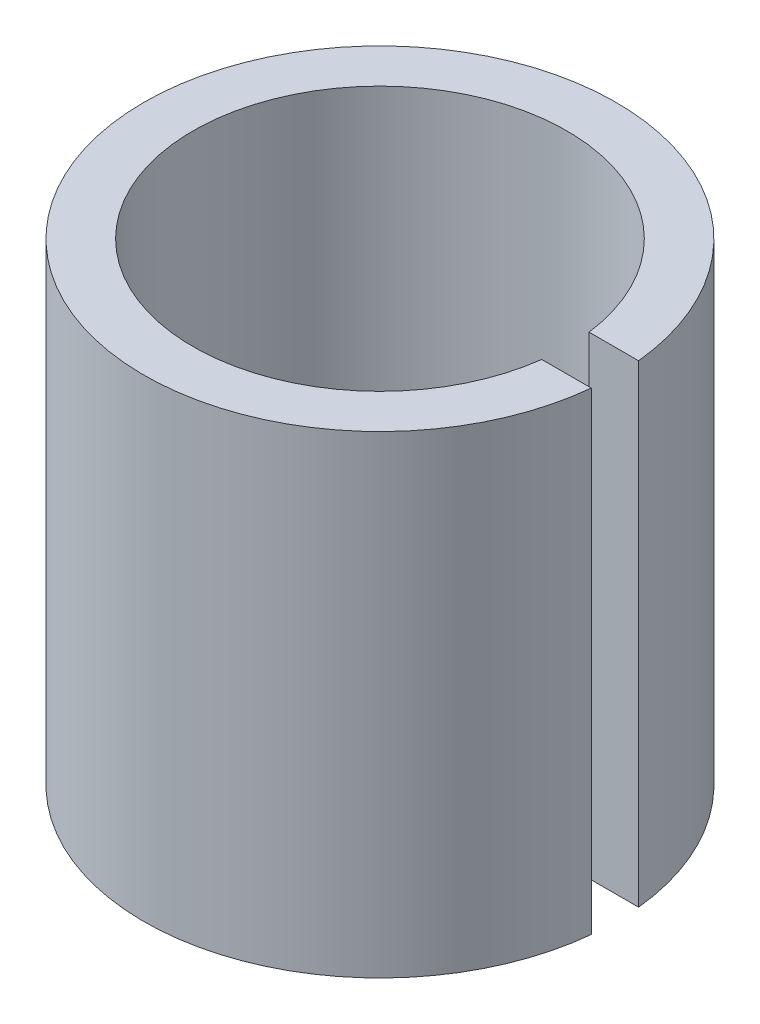
ISO-10303-21;
HEADER;
FILE_DESCRIPTION(('STEP AP214'),'2;1');
FILE_NAME('part.step','',(''),(''),'','','');
FILE_SCHEMA(('AUTOMOTIVE_DESIGN { 1 0 10303 214 1 1 1 1 }'));
ENDSEC;
DATA;
#1=APPLICATION_CONTEXT('core data for automotive mechanical design processes');
#2=APPLICATION_PROTOCOL_DEFINITION('international standard','automotive_design',2000,#1);
#3=PRODUCT_CONTEXT('',#1,'mechanical');
#4=PRODUCT('Part','Part','',(#3));
#5=PRODUCT_RELATED_PRODUCT_CATEGORY('part','',(#4));
#6=PRODUCT_DEFINITION_FORMATION('','',#4);
#7=PRODUCT_DEFINITION_CONTEXT('part definition',#1,'design');
#8=PRODUCT_DEFINITION('design','',#6,#7);
#9=PRODUCT_DEFINITION_SHAPE('','',#8);
#10=(LENGTH_UNIT() NAMED_UNIT(*) SI_UNIT(.MILLI.,.METRE.));
#11=(NAMED_UNIT(*) PLANE_ANGLE_UNIT() SI_UNIT($,.RADIAN.));
#12=(NAMED_UNIT(*) SI_UNIT($,.STERADIAN.) SOLID_ANGLE_UNIT());
#13=UNCERTAINTY_MEASURE_WITH_UNIT(LENGTH_MEASURE(1.E-05),#10,'distance_accuracy_value','');
#14=(GEOMETRIC_REPRESENTATION_CONTEXT(3) GLOBAL_UNCERTAINTY_ASSIGNED_CONTEXT((#13)) GLOBAL_UNIT_ASSIGNED_CONTEXT((#10,
#11,#12)) REPRESENTATION_CONTEXT('',''));
#15=CARTESIAN_POINT('',(0.,0.,0.));
#16=DIRECTION('',(0.,0.,1.));
#17=DIRECTION('',(1.,0.,0.));
#18=AXIS2_PLACEMENT_3D('',#15,#16,#17);
#19=CARTESIAN_POINT('',(-34.2752174495392,32.0392577935446,0.642077483917092));
#20=DIRECTION('',(0.,-1.,0.));
#21=DIRECTION('',(0.,0.,-1.));
#22=AXIS2_PLACEMENT_3D('',#19,#20,#21);
#23=CYLINDRICAL_SURFACE('',#22,6.3373);
#24=CARTESIAN_POINT('',(-34.2752174495392,19.3392577935446,0.642077483917092));
#25=DIRECTION('',(0.,1.,0.));
#26=DIRECTION('',(0.,0.,1.));
#27=AXIS2_PLACEMENT_3D('',#24,#25,#26);
#28=CIRCLE('',#27,6.3373);
#29=CARTESIAN_POINT('',(-27.9698113333561,19.3392577935446,0.00707748391709192));
#30=VERTEX_POINT('',#29);
#31=CARTESIAN_POINT('',(-27.9698113333561,19.3392577935446,1.27707748391709));
#32=VERTEX_POINT('',#31);
#33=EDGE_CURVE('E79',#30,#32,#28,.T.);
#34=ORIENTED_EDGE('',*,*,#33,.T.);
#35=DIRECTION('',(0.,-1.,0.));
#36=VECTOR('',#35,1.);
#37=CARTESIAN_POINT('',(-27.9698113333561,32.0392577935446,1.27707748391709));
#38=LINE('',#37,#36);
#39=CARTESIAN_POINT('',(-27.9698113333561,32.0392577935446,1.27707748391709));
#40=VERTEX_POINT('',#39);
#41=EDGE_CURVE('E10',#40,#32,#38,.T.);
#42=ORIENTED_EDGE('',*,*,#41,.F.);
#43=CARTESIAN_POINT('',(-34.2752174495392,32.0392577935446,0.642077483917092));
#44=DIRECTION('',(0.,1.,0.));
#45=DIRECTION('',(0.,0.,1.));
#46=AXIS2_PLACEMENT_3D('',#43,#44,#45);
#47=CIRCLE('',#46,6.3373);
#48=CARTESIAN_POINT('',(-27.9698113333561,32.0392577935446,0.00707748391709192));
#49=VERTEX_POINT('',#48);
#50=EDGE_CURVE('E67',#49,#40,#47,.T.);
#51=ORIENTED_EDGE('',*,*,#50,.F.);
#52=DIRECTION('',(0.,-1.,0.));
#53=VECTOR('',#52,1.);
#54=CARTESIAN_POINT('',(-27.9698113333561,32.0392577935446,0.00707748391709192));
#55=LINE('',#54,#53);
#56=EDGE_CURVE('E75',#49,#30,#55,.T.);
#57=ORIENTED_EDGE('',*,*,#56,.T.);
#58=EDGE_LOOP('',(#34,#42,#51,#57));
#59=FACE_BOUND('',#58,.T.);
#60=ADVANCED_FACE('F16',(#59),#23,.T.);
#61=CARTESIAN_POINT('',(-29.2990696171291,32.0392577935446,1.27707748391709));
#62=DIRECTION('',(0.,0.,1.));
#63=DIRECTION('',(1.,0.,0.));
#64=AXIS2_PLACEMENT_3D('',#61,#62,#63);
#65=PLANE('',#64);
#66=DIRECTION('',(-1.,0.,0.));
#67=VECTOR('',#66,1.);
#68=CARTESIAN_POINT('',(-29.2990696171291,19.3392577935446,1.27707748391709));
#69=LINE('',#68,#67);
#70=CARTESIAN_POINT('',(-29.2990696171291,19.3392577935446,1.27707748391709));
#71=VERTEX_POINT('',#70);
#72=EDGE_CURVE('E71',#32,#71,#69,.T.);
#73=ORIENTED_EDGE('',*,*,#72,.T.);
#74=DIRECTION('',(0.,-1.,0.));
#75=VECTOR('',#74,1.);
#76=CARTESIAN_POINT('',(-29.2990696171291,32.0392577935446,1.27707748391709));
#77=LINE('',#76,#75);
#78=CARTESIAN_POINT('',(-29.2990696171291,32.0392577935446,1.27707748391709));
#79=VERTEX_POINT('',#78);
#80=EDGE_CURVE('E24',#79,#71,#77,.T.);
#81=ORIENTED_EDGE('',*,*,#80,.F.);
#82=DIRECTION('',(-1.,0.,0.));
#83=VECTOR('',#82,1.);
#84=CARTESIAN_POINT('',(-29.2990696171291,32.0392577935446,1.27707748391709));
#85=LINE('',#84,#83);
#86=EDGE_CURVE('E62',#40,#79,#85,.T.);
#87=ORIENTED_EDGE('',*,*,#86,.F.);
#88=ORIENTED_EDGE('',*,*,#41,.T.);
#89=EDGE_LOOP('',(#73,#81,#87,#88));
#90=FACE_BOUND('',#89,.T.);
#91=ADVANCED_FACE('F70',(#90),#65,.F.);
#92=CARTESIAN_POINT('',(-34.2752174495392,32.0392577935446,0.642077483917092));
#93=DIRECTION('',(0.,-1.,0.));
#94=DIRECTION('',(0.,0.,-1.));
#95=AXIS2_PLACEMENT_3D('',#92,#93,#94);
#96=CYLINDRICAL_SURFACE('',#95,5.0165);
#97=CARTESIAN_POINT('',(-34.2752174495392,19.3392577935446,0.642077483917092));
#98=DIRECTION('',(0.,-1.,0.));
#99=DIRECTION('',(0.,0.,1.));
#100=AXIS2_PLACEMENT_3D('',#97,#98,#99);
#101=CIRCLE('',#100,5.0165);
#102=CARTESIAN_POINT('',(-29.2990696171291,19.3392577935446,0.00707748391709224));
#103=VERTEX_POINT('',#102);
#104=EDGE_CURVE('E49',#71,#103,#101,.T.);
#105=ORIENTED_EDGE('',*,*,#104,.T.);
#106=DIRECTION('',(0.,-1.,0.));
#107=VECTOR('',#106,1.);
#108=CARTESIAN_POINT('',(-29.2990696171291,32.0392577935446,0.00707748391709224));
#109=LINE('',#108,#107);
#110=CARTESIAN_POINT('',(-29.2990696171291,32.0392577935446,0.00707748391709224));
#111=VERTEX_POINT('',#110);
#112=EDGE_CURVE('E72',#111,#103,#109,.T.);
#113=ORIENTED_EDGE('',*,*,#112,.F.);
#114=CARTESIAN_POINT('',(-34.2752174495392,32.0392577935446,0.642077483917092));
#115=DIRECTION('',(0.,-1.,0.));
#116=DIRECTION('',(0.,0.,1.));
#117=AXIS2_PLACEMENT_3D('',#114,#115,#116);
#118=CIRCLE('',#117,5.0165);
#119=EDGE_CURVE('E65',#79,#111,#118,.T.);
#120=ORIENTED_EDGE('',*,*,#119,.F.);
#121=ORIENTED_EDGE('',*,*,#80,.T.);
#122=EDGE_LOOP('',(#105,#113,#120,#121));
#123=FACE_BOUND('',#122,.T.);
#124=ADVANCED_FACE('F73',(#123),#96,.F.);
#125=CARTESIAN_POINT('',(-27.9698113333561,32.0392577935446,0.00707748391709192));
#126=DIRECTION('',(0.,0.,-1.));
#127=DIRECTION('',(-1.,0.,0.));
#128=AXIS2_PLACEMENT_3D('',#125,#126,#127);
#129=PLANE('',#128);
#130=DIRECTION('',(1.,0.,0.));
#131=VECTOR('',#130,1.);
#132=CARTESIAN_POINT('',(-27.9698113333561,19.3392577935446,0.00707748391709192));
#133=LINE('',#132,#131);
#134=EDGE_CURVE('E55',#103,#30,#133,.T.);
#135=ORIENTED_EDGE('',*,*,#134,.T.);
#136=ORIENTED_EDGE('',*,*,#56,.F.);
#137=DIRECTION('',(1.,0.,0.));
#138=VECTOR('',#137,1.);
#139=CARTESIAN_POINT('',(-27.9698113333561,32.0392577935446,0.00707748391709192));
#140=LINE('',#139,#138);
#141=EDGE_CURVE('E32',#111,#49,#140,.T.);
#142=ORIENTED_EDGE('',*,*,#141,.F.);
#143=ORIENTED_EDGE('',*,*,#112,.T.);
#144=EDGE_LOOP('',(#135,#136,#142,#143));
#145=FACE_BOUND('',#144,.T.);
#146=ADVANCED_FACE('F86',(#145),#129,.F.);
#147=CARTESIAN_POINT('',(-34.2752174495392,32.0392577935446,0.642077483917092));
#148=DIRECTION('',(0.,1.,0.));
#149=DIRECTION('',(0.,0.,1.));
#150=AXIS2_PLACEMENT_3D('',#147,#148,#149);
#151=PLANE('',#150);
#152=ORIENTED_EDGE('',*,*,#50,.T.);
#153=ORIENTED_EDGE('',*,*,#86,.T.);
#154=ORIENTED_EDGE('',*,*,#119,.T.);
#155=ORIENTED_EDGE('',*,*,#141,.T.);
#156=EDGE_LOOP('',(#152,#153,#154,#155));
#157=FACE_BOUND('',#156,.T.);
#158=ADVANCED_FACE('F63',(#157),#151,.T.);
#159=CARTESIAN_POINT('',(-34.2752174495392,19.3392577935446,0.642077483917092));
#160=DIRECTION('',(0.,1.,0.));
#161=DIRECTION('',(0.,0.,1.));
#162=AXIS2_PLACEMENT_3D('',#159,#160,#161);
#163=PLANE('',#162);
#164=ORIENTED_EDGE('',*,*,#33,.F.);
#165=ORIENTED_EDGE('',*,*,#134,.F.);
#166=ORIENTED_EDGE('',*,*,#104,.F.);
#167=ORIENTED_EDGE('',*,*,#72,.F.);
#168=EDGE_LOOP('',(#164,#165,#166,#167));
#169=FACE_BOUND('',#168,.T.);
#170=ADVANCED_FACE('F89',(#169),#163,.F.);
#171=CLOSED_SHELL('',(#60,#91,#124,#146,#158,#170));
#172=MANIFOLD_SOLID_BREP('B1',#171);
#173=ADVANCED_BREP_SHAPE_REPRESENTATION('',(#18,#172),#14);
#174=SHAPE_DEFINITION_REPRESENTATION(#9,#173);
ENDSEC;
END-ISO-10303-21;
